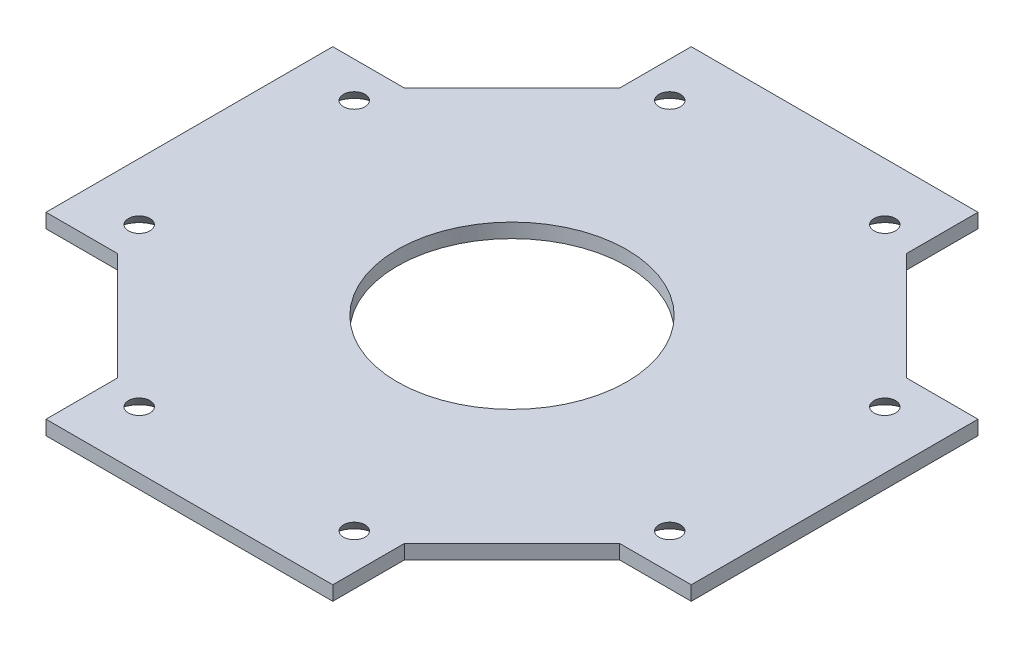
ISO-10303-21;
HEADER;
FILE_DESCRIPTION(('STEP AP214'),'2;1');
FILE_NAME('part.step','',(''),(''),'','','');
FILE_SCHEMA(('AUTOMOTIVE_DESIGN { 1 0 10303 214 1 1 1 1 }'));
ENDSEC;
DATA;
#1=APPLICATION_CONTEXT('core data for automotive mechanical design processes');
#2=APPLICATION_PROTOCOL_DEFINITION('international standard','automotive_design',2000,#1);
#3=PRODUCT_CONTEXT('',#1,'mechanical');
#4=PRODUCT('Part','Part','',(#3));
#5=PRODUCT_RELATED_PRODUCT_CATEGORY('part','',(#4));
#6=PRODUCT_DEFINITION_FORMATION('','',#4);
#7=PRODUCT_DEFINITION_CONTEXT('part definition',#1,'design');
#8=PRODUCT_DEFINITION('design','',#6,#7);
#9=PRODUCT_DEFINITION_SHAPE('','',#8);
#10=(LENGTH_UNIT() NAMED_UNIT(*) SI_UNIT(.MILLI.,.METRE.));
#11=(NAMED_UNIT(*) PLANE_ANGLE_UNIT() SI_UNIT($,.RADIAN.));
#12=(NAMED_UNIT(*) SI_UNIT($,.STERADIAN.) SOLID_ANGLE_UNIT());
#13=UNCERTAINTY_MEASURE_WITH_UNIT(LENGTH_MEASURE(1.E-05),#10,'distance_accuracy_value','');
#14=(GEOMETRIC_REPRESENTATION_CONTEXT(3) GLOBAL_UNCERTAINTY_ASSIGNED_CONTEXT((#13)) GLOBAL_UNIT_ASSIGNED_CONTEXT((#10,
#11,#12)) REPRESENTATION_CONTEXT('',''));
#15=CARTESIAN_POINT('',(0.,0.,0.));
#16=DIRECTION('',(0.,0.,1.));
#17=DIRECTION('',(1.,0.,0.));
#18=AXIS2_PLACEMENT_3D('',#15,#16,#17);
#19=CARTESIAN_POINT('',(0.,2.,0.));
#20=DIRECTION('',(0.,1.,0.));
#21=DIRECTION('',(0.,0.,1.));
#22=AXIS2_PLACEMENT_3D('',#19,#20,#21);
#23=PLANE('',#22);
#24=CARTESIAN_POINT('',(37.,2.,-14.9999999999999));
#25=DIRECTION('',(0.,1.,0.));
#26=DIRECTION('',(-1.,0.,0.));
#27=AXIS2_PLACEMENT_3D('',#24,#25,#26);
#28=CIRCLE('',#27,1.5);
#29=CARTESIAN_POINT('',(35.5,2.,-14.9999999999999));
#30=VERTEX_POINT('',#29);
#31=EDGE_CURVE('E314',#30,#30,#28,.T.);
#32=ORIENTED_EDGE('',*,*,#31,.F.);
#33=EDGE_LOOP('',(#32));
#34=FACE_BOUND('',#33,.T.);
#35=CARTESIAN_POINT('',(-36.9999999999999,2.,-15.0000000000001));
#36=DIRECTION('',(0.,-1.,0.));
#37=DIRECTION('',(1.,0.,0.));
#38=AXIS2_PLACEMENT_3D('',#35,#36,#37);
#39=CIRCLE('',#38,1.5);
#40=CARTESIAN_POINT('',(-35.4999999999999,2.,-15.0000000000001));
#41=VERTEX_POINT('',#40);
#42=EDGE_CURVE('E302',#41,#41,#39,.T.);
#43=ORIENTED_EDGE('',*,*,#42,.T.);
#44=EDGE_LOOP('',(#43));
#45=FACE_BOUND('',#44,.T.);
#46=CARTESIAN_POINT('',(-37.,2.,14.9999999999999));
#47=DIRECTION('',(0.,1.,0.));
#48=DIRECTION('',(1.,0.,0.));
#49=AXIS2_PLACEMENT_3D('',#46,#47,#48);
#50=CIRCLE('',#49,1.5);
#51=CARTESIAN_POINT('',(-35.5,2.,14.9999999999999));
#52=VERTEX_POINT('',#51);
#53=EDGE_CURVE('E296',#52,#52,#50,.T.);
#54=ORIENTED_EDGE('',*,*,#53,.F.);
#55=EDGE_LOOP('',(#54));
#56=FACE_BOUND('',#55,.T.);
#57=CARTESIAN_POINT('',(15.,2.,-37.));
#58=DIRECTION('',(0.,-1.,0.));
#59=DIRECTION('',(0.,0.,1.));
#60=AXIS2_PLACEMENT_3D('',#57,#58,#59);
#61=CIRCLE('',#60,1.5);
#62=CARTESIAN_POINT('',(15.,2.,-35.5));
#63=VERTEX_POINT('',#62);
#64=EDGE_CURVE('E278',#63,#63,#61,.T.);
#65=ORIENTED_EDGE('',*,*,#64,.T.);
#66=EDGE_LOOP('',(#65));
#67=FACE_BOUND('',#66,.T.);
#68=CARTESIAN_POINT('',(-15.,2.,-37.));
#69=DIRECTION('',(0.,1.,0.));
#70=DIRECTION('',(0.,0.,1.));
#71=AXIS2_PLACEMENT_3D('',#68,#69,#70);
#72=CIRCLE('',#71,1.5);
#73=CARTESIAN_POINT('',(-15.,2.,-35.5));
#74=VERTEX_POINT('',#73);
#75=EDGE_CURVE('E272',#74,#74,#72,.T.);
#76=ORIENTED_EDGE('',*,*,#75,.F.);
#77=EDGE_LOOP('',(#76));
#78=FACE_BOUND('',#77,.T.);
#79=DIRECTION('',(0.,0.,1.));
#80=VECTOR('',#79,1.);
#81=CARTESIAN_POINT('',(20.,2.,-35.));
#82=LINE('',#81,#80);
#83=CARTESIAN_POINT('',(20.,2.,-45.));
#84=VERTEX_POINT('',#83);
#85=CARTESIAN_POINT('',(20.,2.,-35.));
#86=VERTEX_POINT('',#85);
#87=EDGE_CURVE('E265',#84,#86,#82,.T.);
#88=ORIENTED_EDGE('',*,*,#87,.F.);
#89=DIRECTION('',(-1.,0.,0.));
#90=VECTOR('',#89,1.);
#91=CARTESIAN_POINT('',(-20.,2.,-45.));
#92=LINE('',#91,#90);
#93=CARTESIAN_POINT('',(-20.,2.,-45.));
#94=VERTEX_POINT('',#93);
#95=EDGE_CURVE('E147',#84,#94,#92,.T.);
#96=ORIENTED_EDGE('',*,*,#95,.T.);
#97=DIRECTION('',(0.,0.,1.));
#98=VECTOR('',#97,1.);
#99=CARTESIAN_POINT('',(-20.,2.,-35.));
#100=LINE('',#99,#98);
#101=CARTESIAN_POINT('',(-20.,2.,-35.));
#102=VERTEX_POINT('',#101);
#103=EDGE_CURVE('E53',#94,#102,#100,.T.);
#104=ORIENTED_EDGE('',*,*,#103,.T.);
#105=DIRECTION('',(-0.707106781186548,0.,0.707106781186547));
#106=VECTOR('',#105,1.);
#107=CARTESIAN_POINT('',(-20.,2.,-35.));
#108=LINE('',#107,#106);
#109=CARTESIAN_POINT('',(-35.,2.,-20.));
#110=VERTEX_POINT('',#109);
#111=EDGE_CURVE('E174',#102,#110,#108,.T.);
#112=ORIENTED_EDGE('',*,*,#111,.T.);
#113=DIRECTION('',(-1.,0.,0.));
#114=VECTOR('',#113,1.);
#115=CARTESIAN_POINT('',(-35.,2.,-20.));
#116=LINE('',#115,#114);
#117=CARTESIAN_POINT('',(-45.,2.,-20.));
#118=VERTEX_POINT('',#117);
#119=EDGE_CURVE('E97',#110,#118,#116,.T.);
#120=ORIENTED_EDGE('',*,*,#119,.T.);
#121=DIRECTION('',(0.,0.,1.));
#122=VECTOR('',#121,1.);
#123=CARTESIAN_POINT('',(-45.,2.,-20.));
#124=LINE('',#123,#122);
#125=CARTESIAN_POINT('',(-45.,2.,20.));
#126=VERTEX_POINT('',#125);
#127=EDGE_CURVE('E189',#118,#126,#124,.T.);
#128=ORIENTED_EDGE('',*,*,#127,.T.);
#129=DIRECTION('',(1.,0.,0.));
#130=VECTOR('',#129,1.);
#131=CARTESIAN_POINT('',(-45.,2.,20.));
#132=LINE('',#131,#130);
#133=CARTESIAN_POINT('',(-35.,2.,20.));
#134=VERTEX_POINT('',#133);
#135=EDGE_CURVE('E202',#126,#134,#132,.T.);
#136=ORIENTED_EDGE('',*,*,#135,.T.);
#137=DIRECTION('',(0.707106781186547,0.,0.707106781186547));
#138=VECTOR('',#137,1.);
#139=CARTESIAN_POINT('',(-35.,2.,20.));
#140=LINE('',#139,#138);
#141=CARTESIAN_POINT('',(-20.,2.,35.));
#142=VERTEX_POINT('',#141);
#143=EDGE_CURVE('E124',#134,#142,#140,.T.);
#144=ORIENTED_EDGE('',*,*,#143,.T.);
#145=DIRECTION('',(0.,0.,1.));
#146=VECTOR('',#145,1.);
#147=CARTESIAN_POINT('',(-20.,2.,35.));
#148=LINE('',#147,#146);
#149=CARTESIAN_POINT('',(-20.,2.,45.));
#150=VERTEX_POINT('',#149);
#151=EDGE_CURVE('E114',#142,#150,#148,.T.);
#152=ORIENTED_EDGE('',*,*,#151,.T.);
#153=DIRECTION('',(1.,0.,0.));
#154=VECTOR('',#153,1.);
#155=CARTESIAN_POINT('',(-20.,2.,45.));
#156=LINE('',#155,#154);
#157=CARTESIAN_POINT('',(20.,2.,45.));
#158=VERTEX_POINT('',#157);
#159=EDGE_CURVE('E121',#150,#158,#156,.T.);
#160=ORIENTED_EDGE('',*,*,#159,.T.);
#161=DIRECTION('',(0.,0.,1.));
#162=VECTOR('',#161,1.);
#163=CARTESIAN_POINT('',(20.,2.,35.));
#164=LINE('',#163,#162);
#165=CARTESIAN_POINT('',(20.,2.,35.));
#166=VERTEX_POINT('',#165);
#167=EDGE_CURVE('E263',#166,#158,#164,.T.);
#168=ORIENTED_EDGE('',*,*,#167,.F.);
#169=DIRECTION('',(-0.707106781186548,0.,0.707106781186547));
#170=VECTOR('',#169,1.);
#171=CARTESIAN_POINT('',(35.,2.,20.));
#172=LINE('',#171,#170);
#173=CARTESIAN_POINT('',(35.,2.,20.));
#174=VERTEX_POINT('',#173);
#175=EDGE_CURVE('E260',#174,#166,#172,.T.);
#176=ORIENTED_EDGE('',*,*,#175,.F.);
#177=DIRECTION('',(-1.,0.,0.));
#178=VECTOR('',#177,1.);
#179=CARTESIAN_POINT('',(45.,2.,20.));
#180=LINE('',#179,#178);
#181=CARTESIAN_POINT('',(45.,2.,20.));
#182=VERTEX_POINT('',#181);
#183=EDGE_CURVE('E257',#182,#174,#180,.T.);
#184=ORIENTED_EDGE('',*,*,#183,.F.);
#185=DIRECTION('',(0.,0.,1.));
#186=VECTOR('',#185,1.);
#187=CARTESIAN_POINT('',(45.,2.,-20.));
#188=LINE('',#187,#186);
#189=CARTESIAN_POINT('',(45.,2.,-20.));
#190=VERTEX_POINT('',#189);
#191=EDGE_CURVE('E254',#190,#182,#188,.T.);
#192=ORIENTED_EDGE('',*,*,#191,.F.);
#193=DIRECTION('',(1.,0.,0.));
#194=VECTOR('',#193,1.);
#195=CARTESIAN_POINT('',(35.,2.,-20.));
#196=LINE('',#195,#194);
#197=CARTESIAN_POINT('',(35.,2.,-20.));
#198=VERTEX_POINT('',#197);
#199=EDGE_CURVE('E228',#198,#190,#196,.T.);
#200=ORIENTED_EDGE('',*,*,#199,.F.);
#201=DIRECTION('',(0.707106781186548,0.,0.707106781186547));
#202=VECTOR('',#201,1.);
#203=CARTESIAN_POINT('',(20.,2.,-35.));
#204=LINE('',#203,#202);
#205=EDGE_CURVE('E232',#86,#198,#204,.T.);
#206=ORIENTED_EDGE('',*,*,#205,.F.);
#207=EDGE_LOOP('',(#88,#96,#104,#112,#120,#128,#136,#144,#152,#160,#168,#176,#184,#192,#200,#206));
#208=FACE_BOUND('',#207,.T.);
#209=CARTESIAN_POINT('',(0.,2.,0.));
#210=DIRECTION('',(0.,-1.,0.));
#211=DIRECTION('',(0.,0.,1.));
#212=AXIS2_PLACEMENT_3D('',#209,#210,#211);
#213=CIRCLE('',#212,16.);
#214=CARTESIAN_POINT('',(0.,2.,16.));
#215=VERTEX_POINT('',#214);
#216=EDGE_CURVE('E144',#215,#215,#213,.T.);
#217=ORIENTED_EDGE('',*,*,#216,.T.);
#218=EDGE_LOOP('',(#217));
#219=FACE_BOUND('',#218,.T.);
#220=CARTESIAN_POINT('',(15.,2.,37.));
#221=DIRECTION('',(0.,1.,0.));
#222=DIRECTION('',(0.,0.,-1.));
#223=AXIS2_PLACEMENT_3D('',#220,#221,#222);
#224=CIRCLE('',#223,1.5);
#225=CARTESIAN_POINT('',(15.,2.,35.5));
#226=VERTEX_POINT('',#225);
#227=EDGE_CURVE('E284',#226,#226,#224,.T.);
#228=ORIENTED_EDGE('',*,*,#227,.F.);
#229=EDGE_LOOP('',(#228));
#230=FACE_BOUND('',#229,.T.);
#231=CARTESIAN_POINT('',(-15.,2.,37.));
#232=DIRECTION('',(0.,-1.,0.));
#233=DIRECTION('',(0.,0.,-1.));
#234=AXIS2_PLACEMENT_3D('',#231,#232,#233);
#235=CIRCLE('',#234,1.5);
#236=CARTESIAN_POINT('',(-15.,2.,35.5));
#237=VERTEX_POINT('',#236);
#238=EDGE_CURVE('E290',#237,#237,#235,.T.);
#239=ORIENTED_EDGE('',*,*,#238,.T.);
#240=EDGE_LOOP('',(#239));
#241=FACE_BOUND('',#240,.T.);
#242=CARTESIAN_POINT('',(36.9999999999999,2.,15.0000000000001));
#243=DIRECTION('',(0.,-1.,0.));
#244=DIRECTION('',(-1.,0.,0.));
#245=AXIS2_PLACEMENT_3D('',#242,#243,#244);
#246=CIRCLE('',#245,1.5);
#247=CARTESIAN_POINT('',(35.4999999999999,2.,15.0000000000001));
#248=VERTEX_POINT('',#247);
#249=EDGE_CURVE('E308',#248,#248,#246,.T.);
#250=ORIENTED_EDGE('',*,*,#249,.T.);
#251=EDGE_LOOP('',(#250));
#252=FACE_BOUND('',#251,.T.);
#253=ADVANCED_FACE('F36',(#34,#45,#56,#67,#78,#208,#219,#230,#241,#252),#23,.T.);
#254=CARTESIAN_POINT('',(0.,0.,0.));
#255=DIRECTION('',(0.,1.,0.));
#256=DIRECTION('',(0.,0.,1.));
#257=AXIS2_PLACEMENT_3D('',#254,#255,#256);
#258=PLANE('',#257);
#259=CARTESIAN_POINT('',(37.,0.,-14.9999999999999));
#260=DIRECTION('',(0.,1.,0.));
#261=DIRECTION('',(0.,0.,1.));
#262=AXIS2_PLACEMENT_3D('',#259,#260,#261);
#263=CIRCLE('',#262,3.17819926235457);
#264=CARTESIAN_POINT('',(37.,0.,-11.8218007376453));
#265=VERTEX_POINT('',#264);
#266=EDGE_CURVE('E311',#265,#265,#263,.T.);
#267=ORIENTED_EDGE('',*,*,#266,.T.);
#268=EDGE_LOOP('',(#267));
#269=FACE_BOUND('',#268,.T.);
#270=CARTESIAN_POINT('',(-36.9999999999999,0.,-15.0000000000001));
#271=DIRECTION('',(0.,1.,0.));
#272=DIRECTION('',(0.,0.,1.));
#273=AXIS2_PLACEMENT_3D('',#270,#271,#272);
#274=CIRCLE('',#273,3.17819926235457);
#275=CARTESIAN_POINT('',(-36.9999999999999,0.,-11.8218007376456));
#276=VERTEX_POINT('',#275);
#277=EDGE_CURVE('E299',#276,#276,#274,.F.);
#278=ORIENTED_EDGE('',*,*,#277,.F.);
#279=EDGE_LOOP('',(#278));
#280=FACE_BOUND('',#279,.T.);
#281=CARTESIAN_POINT('',(-37.,0.,14.9999999999999));
#282=DIRECTION('',(0.,1.,0.));
#283=DIRECTION('',(0.,0.,1.));
#284=AXIS2_PLACEMENT_3D('',#281,#282,#283);
#285=CIRCLE('',#284,3.17819926235457);
#286=CARTESIAN_POINT('',(-37.,0.,18.1781992623544));
#287=VERTEX_POINT('',#286);
#288=EDGE_CURVE('E293',#287,#287,#285,.T.);
#289=ORIENTED_EDGE('',*,*,#288,.T.);
#290=EDGE_LOOP('',(#289));
#291=FACE_BOUND('',#290,.T.);
#292=CARTESIAN_POINT('',(15.,0.,-37.));
#293=DIRECTION('',(0.,1.,0.));
#294=DIRECTION('',(0.,0.,1.));
#295=AXIS2_PLACEMENT_3D('',#292,#293,#294);
#296=CIRCLE('',#295,3.17819926235457);
#297=CARTESIAN_POINT('',(15.,0.,-33.8218007376454));
#298=VERTEX_POINT('',#297);
#299=EDGE_CURVE('E275',#298,#298,#296,.F.);
#300=ORIENTED_EDGE('',*,*,#299,.F.);
#301=EDGE_LOOP('',(#300));
#302=FACE_BOUND('',#301,.T.);
#303=CARTESIAN_POINT('',(-15.,0.,-37.));
#304=DIRECTION('',(0.,1.,0.));
#305=DIRECTION('',(0.,0.,1.));
#306=AXIS2_PLACEMENT_3D('',#303,#304,#305);
#307=CIRCLE('',#306,3.17819926235457);
#308=CARTESIAN_POINT('',(-15.,0.,-33.8218007376454));
#309=VERTEX_POINT('',#308);
#310=EDGE_CURVE('E251',#309,#309,#307,.T.);
#311=ORIENTED_EDGE('',*,*,#310,.T.);
#312=EDGE_LOOP('',(#311));
#313=FACE_BOUND('',#312,.T.);
#314=DIRECTION('',(-1.,0.,0.));
#315=VECTOR('',#314,1.);
#316=CARTESIAN_POINT('',(-20.,0.,-45.));
#317=LINE('',#316,#315);
#318=CARTESIAN_POINT('',(20.,0.,-45.));
#319=VERTEX_POINT('',#318);
#320=CARTESIAN_POINT('',(-20.,0.,-45.));
#321=VERTEX_POINT('',#320);
#322=EDGE_CURVE('E83',#319,#321,#317,.T.);
#323=ORIENTED_EDGE('',*,*,#322,.F.);
#324=DIRECTION('',(0.,0.,1.));
#325=VECTOR('',#324,1.);
#326=CARTESIAN_POINT('',(20.,0.,-35.));
#327=LINE('',#326,#325);
#328=CARTESIAN_POINT('',(20.,0.,-35.));
#329=VERTEX_POINT('',#328);
#330=EDGE_CURVE('E245',#319,#329,#327,.T.);
#331=ORIENTED_EDGE('',*,*,#330,.T.);
#332=DIRECTION('',(0.707106781186548,0.,0.707106781186547));
#333=VECTOR('',#332,1.);
#334=CARTESIAN_POINT('',(20.,0.,-35.));
#335=LINE('',#334,#333);
#336=CARTESIAN_POINT('',(35.,0.,-20.));
#337=VERTEX_POINT('',#336);
#338=EDGE_CURVE('E248',#329,#337,#335,.T.);
#339=ORIENTED_EDGE('',*,*,#338,.T.);
#340=DIRECTION('',(1.,0.,0.));
#341=VECTOR('',#340,1.);
#342=CARTESIAN_POINT('',(35.,0.,-20.));
#343=LINE('',#342,#341);
#344=CARTESIAN_POINT('',(45.,0.,-20.));
#345=VERTEX_POINT('',#344);
#346=EDGE_CURVE('E229',#337,#345,#343,.T.);
#347=ORIENTED_EDGE('',*,*,#346,.T.);
#348=DIRECTION('',(0.,0.,1.));
#349=VECTOR('',#348,1.);
#350=CARTESIAN_POINT('',(45.,0.,-20.));
#351=LINE('',#350,#349);
#352=CARTESIAN_POINT('',(45.,0.,20.));
#353=VERTEX_POINT('',#352);
#354=EDGE_CURVE('E233',#345,#353,#351,.T.);
#355=ORIENTED_EDGE('',*,*,#354,.T.);
#356=DIRECTION('',(-1.,0.,0.));
#357=VECTOR('',#356,1.);
#358=CARTESIAN_POINT('',(45.,0.,20.));
#359=LINE('',#358,#357);
#360=CARTESIAN_POINT('',(35.,0.,20.));
#361=VERTEX_POINT('',#360);
#362=EDGE_CURVE('E236',#353,#361,#359,.T.);
#363=ORIENTED_EDGE('',*,*,#362,.T.);
#364=DIRECTION('',(-0.707106781186548,0.,0.707106781186547));
#365=VECTOR('',#364,1.);
#366=CARTESIAN_POINT('',(35.,0.,20.));
#367=LINE('',#366,#365);
#368=CARTESIAN_POINT('',(20.,0.,35.));
#369=VERTEX_POINT('',#368);
#370=EDGE_CURVE('E239',#361,#369,#367,.T.);
#371=ORIENTED_EDGE('',*,*,#370,.T.);
#372=DIRECTION('',(0.,0.,1.));
#373=VECTOR('',#372,1.);
#374=CARTESIAN_POINT('',(20.,0.,35.));
#375=LINE('',#374,#373);
#376=CARTESIAN_POINT('',(20.,0.,45.));
#377=VERTEX_POINT('',#376);
#378=EDGE_CURVE('E242',#369,#377,#375,.T.);
#379=ORIENTED_EDGE('',*,*,#378,.T.);
#380=DIRECTION('',(1.,0.,0.));
#381=VECTOR('',#380,1.);
#382=CARTESIAN_POINT('',(-20.,0.,45.));
#383=LINE('',#382,#381);
#384=CARTESIAN_POINT('',(-20.,0.,45.));
#385=VERTEX_POINT('',#384);
#386=EDGE_CURVE('E167',#385,#377,#383,.T.);
#387=ORIENTED_EDGE('',*,*,#386,.F.);
#388=DIRECTION('',(0.,0.,1.));
#389=VECTOR('',#388,1.);
#390=CARTESIAN_POINT('',(-20.,0.,35.));
#391=LINE('',#390,#389);
#392=CARTESIAN_POINT('',(-20.,0.,35.));
#393=VERTEX_POINT('',#392);
#394=EDGE_CURVE('E133',#393,#385,#391,.T.);
#395=ORIENTED_EDGE('',*,*,#394,.F.);
#396=DIRECTION('',(0.707106781186547,0.,0.707106781186547));
#397=VECTOR('',#396,1.);
#398=CARTESIAN_POINT('',(-35.,0.,20.));
#399=LINE('',#398,#397);
#400=CARTESIAN_POINT('',(-35.,0.,20.));
#401=VERTEX_POINT('',#400);
#402=EDGE_CURVE('E164',#401,#393,#399,.T.);
#403=ORIENTED_EDGE('',*,*,#402,.F.);
#404=DIRECTION('',(1.,0.,0.));
#405=VECTOR('',#404,1.);
#406=CARTESIAN_POINT('',(-45.,0.,20.));
#407=LINE('',#406,#405);
#408=CARTESIAN_POINT('',(-45.,0.,20.));
#409=VERTEX_POINT('',#408);
#410=EDGE_CURVE('E162',#409,#401,#407,.T.);
#411=ORIENTED_EDGE('',*,*,#410,.F.);
#412=DIRECTION('',(0.,0.,1.));
#413=VECTOR('',#412,1.);
#414=CARTESIAN_POINT('',(-45.,0.,-20.));
#415=LINE('',#414,#413);
#416=CARTESIAN_POINT('',(-45.,0.,-20.));
#417=VERTEX_POINT('',#416);
#418=EDGE_CURVE('E160',#417,#409,#415,.T.);
#419=ORIENTED_EDGE('',*,*,#418,.F.);
#420=DIRECTION('',(-1.,0.,0.));
#421=VECTOR('',#420,1.);
#422=CARTESIAN_POINT('',(-35.,0.,-20.));
#423=LINE('',#422,#421);
#424=CARTESIAN_POINT('',(-35.,0.,-20.));
#425=VERTEX_POINT('',#424);
#426=EDGE_CURVE('E157',#425,#417,#423,.T.);
#427=ORIENTED_EDGE('',*,*,#426,.F.);
#428=DIRECTION('',(-0.707106781186548,0.,0.707106781186547));
#429=VECTOR('',#428,1.);
#430=CARTESIAN_POINT('',(-20.,0.,-35.));
#431=LINE('',#430,#429);
#432=CARTESIAN_POINT('',(-20.,0.,-35.));
#433=VERTEX_POINT('',#432);
#434=EDGE_CURVE('E154',#433,#425,#431,.T.);
#435=ORIENTED_EDGE('',*,*,#434,.F.);
#436=DIRECTION('',(0.,0.,1.));
#437=VECTOR('',#436,1.);
#438=CARTESIAN_POINT('',(-20.,0.,-35.));
#439=LINE('',#438,#437);
#440=EDGE_CURVE('E89',#321,#433,#439,.T.);
#441=ORIENTED_EDGE('',*,*,#440,.F.);
#442=EDGE_LOOP('',(#323,#331,#339,#347,#355,#363,#371,#379,#387,#395,#403,#411,#419,#427,#435,#441));
#443=FACE_BOUND('',#442,.T.);
#444=CARTESIAN_POINT('',(0.,0.,0.));
#445=DIRECTION('',(0.,-1.,0.));
#446=DIRECTION('',(0.,0.,1.));
#447=AXIS2_PLACEMENT_3D('',#444,#445,#446);
#448=CIRCLE('',#447,16.);
#449=CARTESIAN_POINT('',(0.,0.,16.));
#450=VERTEX_POINT('',#449);
#451=EDGE_CURVE('E169',#450,#450,#448,.T.);
#452=ORIENTED_EDGE('',*,*,#451,.F.);
#453=EDGE_LOOP('',(#452));
#454=FACE_BOUND('',#453,.T.);
#455=CARTESIAN_POINT('',(15.,0.,37.));
#456=DIRECTION('',(0.,1.,0.));
#457=DIRECTION('',(0.,0.,1.));
#458=AXIS2_PLACEMENT_3D('',#455,#456,#457);
#459=CIRCLE('',#458,3.17819926235457);
#460=CARTESIAN_POINT('',(15.,0.,40.1781992623546));
#461=VERTEX_POINT('',#460);
#462=EDGE_CURVE('E281',#461,#461,#459,.T.);
#463=ORIENTED_EDGE('',*,*,#462,.T.);
#464=EDGE_LOOP('',(#463));
#465=FACE_BOUND('',#464,.T.);
#466=CARTESIAN_POINT('',(-15.,0.,37.));
#467=DIRECTION('',(0.,1.,0.));
#468=DIRECTION('',(0.,0.,1.));
#469=AXIS2_PLACEMENT_3D('',#466,#467,#468);
#470=CIRCLE('',#469,3.17819926235457);
#471=CARTESIAN_POINT('',(-15.,0.,40.1781992623546));
#472=VERTEX_POINT('',#471);
#473=EDGE_CURVE('E287',#472,#472,#470,.F.);
#474=ORIENTED_EDGE('',*,*,#473,.F.);
#475=EDGE_LOOP('',(#474));
#476=FACE_BOUND('',#475,.T.);
#477=CARTESIAN_POINT('',(36.9999999999999,0.,15.0000000000001));
#478=DIRECTION('',(0.,1.,0.));
#479=DIRECTION('',(0.,0.,1.));
#480=AXIS2_PLACEMENT_3D('',#477,#478,#479);
#481=CIRCLE('',#480,3.17819926235457);
#482=CARTESIAN_POINT('',(36.9999999999999,0.,18.1781992623547));
#483=VERTEX_POINT('',#482);
#484=EDGE_CURVE('E305',#483,#483,#481,.F.);
#485=ORIENTED_EDGE('',*,*,#484,.F.);
#486=EDGE_LOOP('',(#485));
#487=FACE_BOUND('',#486,.T.);
#488=ADVANCED_FACE('F192',(#269,#280,#291,#302,#313,#443,#454,#465,#476,#487),#258,.F.);
#489=CARTESIAN_POINT('',(-20.,2.,-35.));
#490=DIRECTION('',(0.707106781186547,0.,0.707106781186548));
#491=DIRECTION('',(0.707106781186548,0.,-0.707106781186547));
#492=AXIS2_PLACEMENT_3D('',#489,#490,#491);
#493=PLANE('',#492);
#494=ORIENTED_EDGE('',*,*,#434,.T.);
#495=DIRECTION('',(0.,-1.,0.));
#496=VECTOR('',#495,1.);
#497=CARTESIAN_POINT('',(-35.,2.,-20.));
#498=LINE('',#497,#496);
#499=EDGE_CURVE('E11',#110,#425,#498,.T.);
#500=ORIENTED_EDGE('',*,*,#499,.F.);
#501=ORIENTED_EDGE('',*,*,#111,.F.);
#502=DIRECTION('',(0.,-1.,0.));
#503=VECTOR('',#502,1.);
#504=CARTESIAN_POINT('',(-20.,2.,-35.));
#505=LINE('',#504,#503);
#506=EDGE_CURVE('E153',#102,#433,#505,.T.);
#507=ORIENTED_EDGE('',*,*,#506,.T.);
#508=EDGE_LOOP('',(#494,#500,#501,#507));
#509=FACE_BOUND('',#508,.T.);
#510=ADVANCED_FACE('F38',(#509),#493,.F.);
#511=CARTESIAN_POINT('',(-35.,2.,-20.));
#512=DIRECTION('',(0.,0.,1.));
#513=DIRECTION('',(1.,0.,0.));
#514=AXIS2_PLACEMENT_3D('',#511,#512,#513);
#515=PLANE('',#514);
#516=ORIENTED_EDGE('',*,*,#426,.T.);
#517=DIRECTION('',(0.,-1.,0.));
#518=VECTOR('',#517,1.);
#519=CARTESIAN_POINT('',(-45.,2.,-20.));
#520=LINE('',#519,#518);
#521=EDGE_CURVE('E45',#118,#417,#520,.T.);
#522=ORIENTED_EDGE('',*,*,#521,.F.);
#523=ORIENTED_EDGE('',*,*,#119,.F.);
#524=ORIENTED_EDGE('',*,*,#499,.T.);
#525=EDGE_LOOP('',(#516,#522,#523,#524));
#526=FACE_BOUND('',#525,.T.);
#527=ADVANCED_FACE('F395',(#526),#515,.F.);
#528=CARTESIAN_POINT('',(-45.,2.,-20.));
#529=DIRECTION('',(1.,0.,0.));
#530=DIRECTION('',(0.,0.,-1.));
#531=AXIS2_PLACEMENT_3D('',#528,#529,#530);
#532=PLANE('',#531);
#533=ORIENTED_EDGE('',*,*,#418,.T.);
#534=DIRECTION('',(0.,-1.,0.));
#535=VECTOR('',#534,1.);
#536=CARTESIAN_POINT('',(-45.,2.,20.));
#537=LINE('',#536,#535);
#538=EDGE_CURVE('E181',#126,#409,#537,.T.);
#539=ORIENTED_EDGE('',*,*,#538,.F.);
#540=ORIENTED_EDGE('',*,*,#127,.F.);
#541=ORIENTED_EDGE('',*,*,#521,.T.);
#542=EDGE_LOOP('',(#533,#539,#540,#541));
#543=FACE_BOUND('',#542,.T.);
#544=ADVANCED_FACE('F187',(#543),#532,.F.);
#545=CARTESIAN_POINT('',(-45.,2.,20.));
#546=DIRECTION('',(0.,0.,-1.));
#547=DIRECTION('',(-1.,0.,0.));
#548=AXIS2_PLACEMENT_3D('',#545,#546,#547);
#549=PLANE('',#548);
#550=ORIENTED_EDGE('',*,*,#410,.T.);
#551=DIRECTION('',(0.,-1.,0.));
#552=VECTOR('',#551,1.);
#553=CARTESIAN_POINT('',(-35.,2.,20.));
#554=LINE('',#553,#552);
#555=EDGE_CURVE('E178',#134,#401,#554,.T.);
#556=ORIENTED_EDGE('',*,*,#555,.F.);
#557=ORIENTED_EDGE('',*,*,#135,.F.);
#558=ORIENTED_EDGE('',*,*,#538,.T.);
#559=EDGE_LOOP('',(#550,#556,#557,#558));
#560=FACE_BOUND('',#559,.T.);
#561=ADVANCED_FACE('F198',(#560),#549,.F.);
#562=CARTESIAN_POINT('',(-35.,2.,20.));
#563=DIRECTION('',(0.707106781186547,0.,-0.707106781186547));
#564=DIRECTION('',(-0.707106781186548,0.,-0.707106781186548));
#565=AXIS2_PLACEMENT_3D('',#562,#563,#564);
#566=PLANE('',#565);
#567=ORIENTED_EDGE('',*,*,#402,.T.);
#568=DIRECTION('',(0.,-1.,0.));
#569=VECTOR('',#568,1.);
#570=CARTESIAN_POINT('',(-20.,2.,35.));
#571=LINE('',#570,#569);
#572=EDGE_CURVE('E137',#142,#393,#571,.T.);
#573=ORIENTED_EDGE('',*,*,#572,.F.);
#574=ORIENTED_EDGE('',*,*,#143,.F.);
#575=ORIENTED_EDGE('',*,*,#555,.T.);
#576=EDGE_LOOP('',(#567,#573,#574,#575));
#577=FACE_BOUND('',#576,.T.);
#578=ADVANCED_FACE('F201',(#577),#566,.F.);
#579=CARTESIAN_POINT('',(-20.,2.,35.));
#580=DIRECTION('',(1.,0.,0.));
#581=DIRECTION('',(0.,0.,-1.));
#582=AXIS2_PLACEMENT_3D('',#579,#580,#581);
#583=PLANE('',#582);
#584=ORIENTED_EDGE('',*,*,#394,.T.);
#585=DIRECTION('',(0.,-1.,0.));
#586=VECTOR('',#585,1.);
#587=CARTESIAN_POINT('',(-20.,2.,45.));
#588=LINE('',#587,#586);
#589=EDGE_CURVE('E130',#150,#385,#588,.T.);
#590=ORIENTED_EDGE('',*,*,#589,.F.);
#591=ORIENTED_EDGE('',*,*,#151,.F.);
#592=ORIENTED_EDGE('',*,*,#572,.T.);
#593=EDGE_LOOP('',(#584,#590,#591,#592));
#594=FACE_BOUND('',#593,.T.);
#595=ADVANCED_FACE('F131',(#594),#583,.F.);
#596=CARTESIAN_POINT('',(-20.,2.,45.));
#597=DIRECTION('',(0.,0.,-1.));
#598=DIRECTION('',(-1.,0.,0.));
#599=AXIS2_PLACEMENT_3D('',#596,#597,#598);
#600=PLANE('',#599);
#601=ORIENTED_EDGE('',*,*,#386,.T.);
#602=DIRECTION('',(0.,-1.,0.));
#603=VECTOR('',#602,1.);
#604=CARTESIAN_POINT('',(20.,2.,45.));
#605=LINE('',#604,#603);
#606=EDGE_CURVE('E142',#158,#377,#605,.T.);
#607=ORIENTED_EDGE('',*,*,#606,.F.);
#608=ORIENTED_EDGE('',*,*,#159,.F.);
#609=ORIENTED_EDGE('',*,*,#589,.T.);
#610=EDGE_LOOP('',(#601,#607,#608,#609));
#611=FACE_BOUND('',#610,.T.);
#612=ADVANCED_FACE('F140',(#611),#600,.F.);
#613=CARTESIAN_POINT('',(0.,2.,0.));
#614=DIRECTION('',(0.,-1.,0.));
#615=DIRECTION('',(0.,0.,-1.));
#616=AXIS2_PLACEMENT_3D('',#613,#614,#615);
#617=CYLINDRICAL_SURFACE('',#616,16.);
#618=ORIENTED_EDGE('',*,*,#451,.T.);
#619=EDGE_LOOP('',(#618));
#620=FACE_BOUND('',#619,.T.);
#621=ORIENTED_EDGE('',*,*,#216,.F.);
#622=EDGE_LOOP('',(#621));
#623=FACE_BOUND('',#622,.T.);
#624=ADVANCED_FACE('F382',(#620,#623),#617,.F.);
#625=CARTESIAN_POINT('',(-20.,2.,-45.));
#626=DIRECTION('',(0.,0.,1.));
#627=DIRECTION('',(1.,0.,0.));
#628=AXIS2_PLACEMENT_3D('',#625,#626,#627);
#629=PLANE('',#628);
#630=ORIENTED_EDGE('',*,*,#322,.T.);
#631=DIRECTION('',(0.,-1.,0.));
#632=VECTOR('',#631,1.);
#633=CARTESIAN_POINT('',(-20.,2.,-45.));
#634=LINE('',#633,#632);
#635=EDGE_CURVE('E138',#94,#321,#634,.T.);
#636=ORIENTED_EDGE('',*,*,#635,.F.);
#637=ORIENTED_EDGE('',*,*,#95,.F.);
#638=DIRECTION('',(0.,-1.,0.));
#639=VECTOR('',#638,1.);
#640=CARTESIAN_POINT('',(20.,2.,-45.));
#641=LINE('',#640,#639);
#642=EDGE_CURVE('E210',#84,#319,#641,.T.);
#643=ORIENTED_EDGE('',*,*,#642,.T.);
#644=EDGE_LOOP('',(#630,#636,#637,#643));
#645=FACE_BOUND('',#644,.T.);
#646=ADVANCED_FACE('F379',(#645),#629,.F.);
#647=CARTESIAN_POINT('',(-20.,2.,-35.));
#648=DIRECTION('',(1.,0.,0.));
#649=DIRECTION('',(0.,0.,-1.));
#650=AXIS2_PLACEMENT_3D('',#647,#648,#649);
#651=PLANE('',#650);
#652=ORIENTED_EDGE('',*,*,#440,.T.);
#653=ORIENTED_EDGE('',*,*,#506,.F.);
#654=ORIENTED_EDGE('',*,*,#103,.F.);
#655=ORIENTED_EDGE('',*,*,#635,.T.);
#656=EDGE_LOOP('',(#652,#653,#654,#655));
#657=FACE_BOUND('',#656,.T.);
#658=ADVANCED_FACE('F371',(#657),#651,.F.);
#659=CARTESIAN_POINT('',(20.,2.,-35.));
#660=DIRECTION('',(0.707106781186547,0.,-0.707106781186548));
#661=DIRECTION('',(-0.707106781186548,0.,-0.707106781186547));
#662=AXIS2_PLACEMENT_3D('',#659,#660,#661);
#663=PLANE('',#662);
#664=ORIENTED_EDGE('',*,*,#338,.F.);
#665=DIRECTION('',(0.,-1.,0.));
#666=VECTOR('',#665,1.);
#667=CARTESIAN_POINT('',(20.,2.,-35.));
#668=LINE('',#667,#666);
#669=EDGE_CURVE('E158',#86,#329,#668,.T.);
#670=ORIENTED_EDGE('',*,*,#669,.F.);
#671=ORIENTED_EDGE('',*,*,#205,.T.);
#672=DIRECTION('',(0.,-1.,0.));
#673=VECTOR('',#672,1.);
#674=CARTESIAN_POINT('',(35.,2.,-20.));
#675=LINE('',#674,#673);
#676=EDGE_CURVE('E225',#198,#337,#675,.T.);
#677=ORIENTED_EDGE('',*,*,#676,.T.);
#678=EDGE_LOOP('',(#664,#670,#671,#677));
#679=FACE_BOUND('',#678,.T.);
#680=ADVANCED_FACE('F368',(#679),#663,.T.);
#681=CARTESIAN_POINT('',(20.,2.,-35.));
#682=DIRECTION('',(1.,0.,0.));
#683=DIRECTION('',(0.,0.,-1.));
#684=AXIS2_PLACEMENT_3D('',#681,#682,#683);
#685=PLANE('',#684);
#686=ORIENTED_EDGE('',*,*,#330,.F.);
#687=ORIENTED_EDGE('',*,*,#642,.F.);
#688=ORIENTED_EDGE('',*,*,#87,.T.);
#689=ORIENTED_EDGE('',*,*,#669,.T.);
#690=EDGE_LOOP('',(#686,#687,#688,#689));
#691=FACE_BOUND('',#690,.T.);
#692=ADVANCED_FACE('F364',(#691),#685,.T.);
#693=CARTESIAN_POINT('',(20.,2.,35.));
#694=DIRECTION('',(1.,0.,0.));
#695=DIRECTION('',(0.,0.,-1.));
#696=AXIS2_PLACEMENT_3D('',#693,#694,#695);
#697=PLANE('',#696);
#698=ORIENTED_EDGE('',*,*,#378,.F.);
#699=DIRECTION('',(0.,-1.,0.));
#700=VECTOR('',#699,1.);
#701=CARTESIAN_POINT('',(20.,2.,35.));
#702=LINE('',#701,#700);
#703=EDGE_CURVE('E213',#166,#369,#702,.T.);
#704=ORIENTED_EDGE('',*,*,#703,.F.);
#705=ORIENTED_EDGE('',*,*,#167,.T.);
#706=ORIENTED_EDGE('',*,*,#606,.T.);
#707=EDGE_LOOP('',(#698,#704,#705,#706));
#708=FACE_BOUND('',#707,.T.);
#709=ADVANCED_FACE('F360',(#708),#697,.T.);
#710=CARTESIAN_POINT('',(35.,2.,20.));
#711=DIRECTION('',(0.707106781186547,0.,0.707106781186548));
#712=DIRECTION('',(0.707106781186548,0.,-0.707106781186547));
#713=AXIS2_PLACEMENT_3D('',#710,#711,#712);
#714=PLANE('',#713);
#715=ORIENTED_EDGE('',*,*,#370,.F.);
#716=DIRECTION('',(0.,-1.,0.));
#717=VECTOR('',#716,1.);
#718=CARTESIAN_POINT('',(35.,2.,20.));
#719=LINE('',#718,#717);
#720=EDGE_CURVE('E216',#174,#361,#719,.T.);
#721=ORIENTED_EDGE('',*,*,#720,.F.);
#722=ORIENTED_EDGE('',*,*,#175,.T.);
#723=ORIENTED_EDGE('',*,*,#703,.T.);
#724=EDGE_LOOP('',(#715,#721,#722,#723));
#725=FACE_BOUND('',#724,.T.);
#726=ADVANCED_FACE('F356',(#725),#714,.T.);
#727=CARTESIAN_POINT('',(45.,2.,20.));
#728=DIRECTION('',(0.,0.,1.));
#729=DIRECTION('',(1.,0.,0.));
#730=AXIS2_PLACEMENT_3D('',#727,#728,#729);
#731=PLANE('',#730);
#732=ORIENTED_EDGE('',*,*,#362,.F.);
#733=DIRECTION('',(0.,-1.,0.));
#734=VECTOR('',#733,1.);
#735=CARTESIAN_POINT('',(45.,2.,20.));
#736=LINE('',#735,#734);
#737=EDGE_CURVE('E219',#182,#353,#736,.T.);
#738=ORIENTED_EDGE('',*,*,#737,.F.);
#739=ORIENTED_EDGE('',*,*,#183,.T.);
#740=ORIENTED_EDGE('',*,*,#720,.T.);
#741=EDGE_LOOP('',(#732,#738,#739,#740));
#742=FACE_BOUND('',#741,.T.);
#743=ADVANCED_FACE('F352',(#742),#731,.T.);
#744=CARTESIAN_POINT('',(45.,2.,-20.));
#745=DIRECTION('',(1.,0.,0.));
#746=DIRECTION('',(0.,0.,-1.));
#747=AXIS2_PLACEMENT_3D('',#744,#745,#746);
#748=PLANE('',#747);
#749=ORIENTED_EDGE('',*,*,#354,.F.);
#750=DIRECTION('',(0.,-1.,0.));
#751=VECTOR('',#750,1.);
#752=CARTESIAN_POINT('',(45.,2.,-20.));
#753=LINE('',#752,#751);
#754=EDGE_CURVE('E222',#190,#345,#753,.T.);
#755=ORIENTED_EDGE('',*,*,#754,.F.);
#756=ORIENTED_EDGE('',*,*,#191,.T.);
#757=ORIENTED_EDGE('',*,*,#737,.T.);
#758=EDGE_LOOP('',(#749,#755,#756,#757));
#759=FACE_BOUND('',#758,.T.);
#760=ADVANCED_FACE('F344',(#759),#748,.T.);
#761=CARTESIAN_POINT('',(35.,2.,-20.));
#762=DIRECTION('',(0.,0.,-1.));
#763=DIRECTION('',(-1.,0.,0.));
#764=AXIS2_PLACEMENT_3D('',#761,#762,#763);
#765=PLANE('',#764);
#766=ORIENTED_EDGE('',*,*,#346,.F.);
#767=ORIENTED_EDGE('',*,*,#676,.F.);
#768=ORIENTED_EDGE('',*,*,#199,.T.);
#769=ORIENTED_EDGE('',*,*,#754,.T.);
#770=EDGE_LOOP('',(#766,#767,#768,#769));
#771=FACE_BOUND('',#770,.T.);
#772=ADVANCED_FACE('F334',(#771),#765,.T.);
#773=CARTESIAN_POINT('',(-15.,2.,-37.));
#774=DIRECTION('',(0.,-1.,0.));
#775=DIRECTION('',(0.,0.,1.));
#776=AXIS2_PLACEMENT_3D('',#773,#774,#775);
#777=CONICAL_SURFACE('',#776,1.5,0.698131700797733);
#778=ORIENTED_EDGE('',*,*,#310,.F.);
#779=EDGE_LOOP('',(#778));
#780=FACE_BOUND('',#779,.T.);
#781=ORIENTED_EDGE('',*,*,#75,.T.);
#782=EDGE_LOOP('',(#781));
#783=FACE_BOUND('',#782,.T.);
#784=ADVANCED_FACE('F331',(#780,#783),#777,.F.);
#785=CARTESIAN_POINT('',(15.,2.,-37.));
#786=DIRECTION('',(0.,-1.,0.));
#787=DIRECTION('',(0.,0.,1.));
#788=AXIS2_PLACEMENT_3D('',#785,#786,#787);
#789=CONICAL_SURFACE('',#788,1.5,0.698131700797733);
#790=ORIENTED_EDGE('',*,*,#299,.T.);
#791=EDGE_LOOP('',(#790));
#792=FACE_BOUND('',#791,.T.);
#793=ORIENTED_EDGE('',*,*,#64,.F.);
#794=EDGE_LOOP('',(#793));
#795=FACE_BOUND('',#794,.T.);
#796=ADVANCED_FACE('F333',(#792,#795),#789,.F.);
#797=CARTESIAN_POINT('',(15.,2.,37.));
#798=DIRECTION('',(0.,-1.,0.));
#799=DIRECTION('',(0.,0.,-1.));
#800=AXIS2_PLACEMENT_3D('',#797,#798,#799);
#801=CONICAL_SURFACE('',#800,1.5,0.698131700797733);
#802=ORIENTED_EDGE('',*,*,#462,.F.);
#803=EDGE_LOOP('',(#802));
#804=FACE_BOUND('',#803,.T.);
#805=ORIENTED_EDGE('',*,*,#227,.T.);
#806=EDGE_LOOP('',(#805));
#807=FACE_BOUND('',#806,.T.);
#808=ADVANCED_FACE('F341',(#804,#807),#801,.F.);
#809=CARTESIAN_POINT('',(-15.,2.,37.));
#810=DIRECTION('',(0.,-1.,0.));
#811=DIRECTION('',(0.,0.,-1.));
#812=AXIS2_PLACEMENT_3D('',#809,#810,#811);
#813=CONICAL_SURFACE('',#812,1.5,0.698131700797733);
#814=ORIENTED_EDGE('',*,*,#473,.T.);
#815=EDGE_LOOP('',(#814));
#816=FACE_BOUND('',#815,.T.);
#817=ORIENTED_EDGE('',*,*,#238,.F.);
#818=EDGE_LOOP('',(#817));
#819=FACE_BOUND('',#818,.T.);
#820=ADVANCED_FACE('F468',(#816,#819),#813,.F.);
#821=CARTESIAN_POINT('',(-37.,2.,14.9999999999999));
#822=DIRECTION('',(0.,-1.,0.));
#823=DIRECTION('',(1.,0.,0.));
#824=AXIS2_PLACEMENT_3D('',#821,#822,#823);
#825=CONICAL_SURFACE('',#824,1.5,0.698131700797733);
#826=ORIENTED_EDGE('',*,*,#288,.F.);
#827=EDGE_LOOP('',(#826));
#828=FACE_BOUND('',#827,.T.);
#829=ORIENTED_EDGE('',*,*,#53,.T.);
#830=EDGE_LOOP('',(#829));
#831=FACE_BOUND('',#830,.T.);
#832=ADVANCED_FACE('F473',(#828,#831),#825,.F.);
#833=CARTESIAN_POINT('',(-36.9999999999999,2.,-15.0000000000001));
#834=DIRECTION('',(0.,-1.,0.));
#835=DIRECTION('',(1.,0.,0.));
#836=AXIS2_PLACEMENT_3D('',#833,#834,#835);
#837=CONICAL_SURFACE('',#836,1.5,0.698131700797733);
#838=ORIENTED_EDGE('',*,*,#277,.T.);
#839=EDGE_LOOP('',(#838));
#840=FACE_BOUND('',#839,.T.);
#841=ORIENTED_EDGE('',*,*,#42,.F.);
#842=EDGE_LOOP('',(#841));
#843=FACE_BOUND('',#842,.T.);
#844=ADVANCED_FACE('F607',(#840,#843),#837,.F.);
#845=CARTESIAN_POINT('',(36.9999999999999,2.,15.0000000000001));
#846=DIRECTION('',(0.,-1.,0.));
#847=DIRECTION('',(-1.,0.,0.));
#848=AXIS2_PLACEMENT_3D('',#845,#846,#847);
#849=CONICAL_SURFACE('',#848,1.5,0.698131700797733);
#850=ORIENTED_EDGE('',*,*,#484,.T.);
#851=EDGE_LOOP('',(#850));
#852=FACE_BOUND('',#851,.T.);
#853=ORIENTED_EDGE('',*,*,#249,.F.);
#854=EDGE_LOOP('',(#853));
#855=FACE_BOUND('',#854,.T.);
#856=ADVANCED_FACE('F611',(#852,#855),#849,.F.);
#857=CARTESIAN_POINT('',(37.,2.,-14.9999999999999));
#858=DIRECTION('',(0.,-1.,0.));
#859=DIRECTION('',(-1.,0.,0.));
#860=AXIS2_PLACEMENT_3D('',#857,#858,#859);
#861=CONICAL_SURFACE('',#860,1.5,0.698131700797733);
#862=ORIENTED_EDGE('',*,*,#266,.F.);
#863=EDGE_LOOP('',(#862));
#864=FACE_BOUND('',#863,.T.);
#865=ORIENTED_EDGE('',*,*,#31,.T.);
#866=EDGE_LOOP('',(#865));
#867=FACE_BOUND('',#866,.T.);
#868=ADVANCED_FACE('F318',(#864,#867),#861,.F.);
#869=CLOSED_SHELL('',(#253,#488,#510,#527,#544,#561,#578,#595,#612,#624,#646,#658,#680,#692,
#709,#726,#743,#760,#772,#784,#796,#808,#820,#832,#844,#856,#868));
#870=MANIFOLD_SOLID_BREP('B2',#869);
#871=ADVANCED_BREP_SHAPE_REPRESENTATION('',(#18,#870),#14);
#872=SHAPE_DEFINITION_REPRESENTATION(#9,#871);
ENDSEC;
END-ISO-10303-21;
